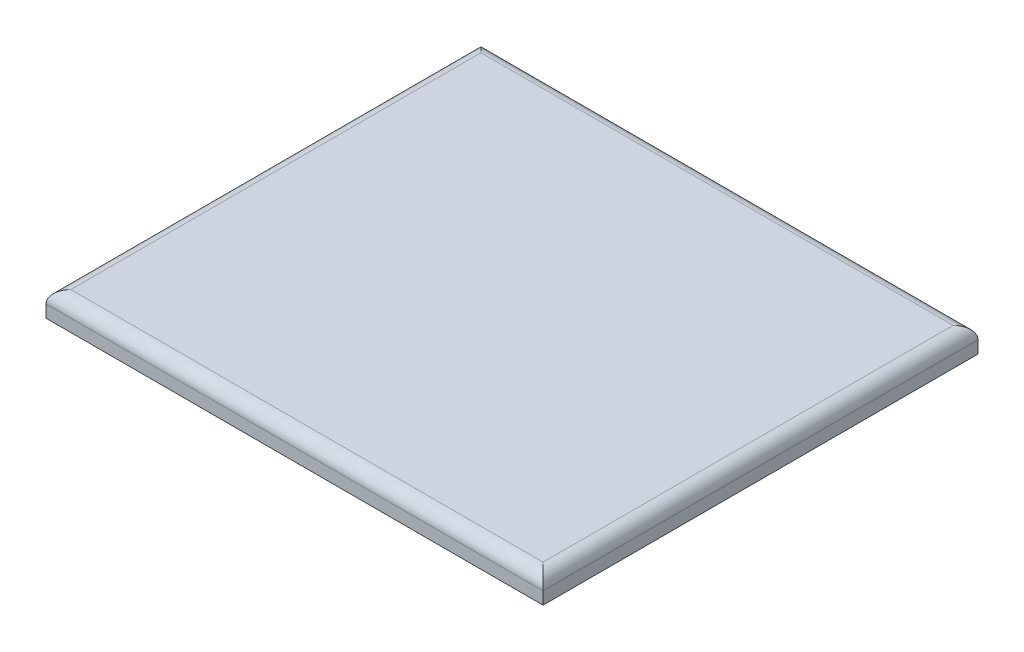
ISO-10303-21;
HEADER;
FILE_DESCRIPTION(('STEP AP214'),'2;1');
FILE_NAME('part.step','',(''),(''),'','','');
FILE_SCHEMA(('AUTOMOTIVE_DESIGN { 1 0 10303 214 1 1 1 1 }'));
ENDSEC;
DATA;
#1=APPLICATION_CONTEXT('core data for automotive mechanical design processes');
#2=APPLICATION_PROTOCOL_DEFINITION('international standard','automotive_design',2000,#1);
#3=PRODUCT_CONTEXT('',#1,'mechanical');
#4=PRODUCT('Part','Part','',(#3));
#5=PRODUCT_RELATED_PRODUCT_CATEGORY('part','',(#4));
#6=PRODUCT_DEFINITION_FORMATION('','',#4);
#7=PRODUCT_DEFINITION_CONTEXT('part definition',#1,'design');
#8=PRODUCT_DEFINITION('design','',#6,#7);
#9=PRODUCT_DEFINITION_SHAPE('','',#8);
#10=(LENGTH_UNIT() NAMED_UNIT(*) SI_UNIT(.MILLI.,.METRE.));
#11=(NAMED_UNIT(*) PLANE_ANGLE_UNIT() SI_UNIT($,.RADIAN.));
#12=(NAMED_UNIT(*) SI_UNIT($,.STERADIAN.) SOLID_ANGLE_UNIT());
#13=UNCERTAINTY_MEASURE_WITH_UNIT(LENGTH_MEASURE(1.E-05),#10,'distance_accuracy_value','');
#14=(GEOMETRIC_REPRESENTATION_CONTEXT(3) GLOBAL_UNCERTAINTY_ASSIGNED_CONTEXT((#13)) GLOBAL_UNIT_ASSIGNED_CONTEXT((#10,
#11,#12)) REPRESENTATION_CONTEXT('',''));
#15=CARTESIAN_POINT('',(0.,0.,0.));
#16=DIRECTION('',(0.,0.,1.));
#17=DIRECTION('',(1.,0.,0.));
#18=AXIS2_PLACEMENT_3D('',#15,#16,#17);
#19=CARTESIAN_POINT('',(200.,20.,175.));
#20=DIRECTION('',(-1.,0.,0.));
#21=DIRECTION('',(0.,0.,1.));
#22=AXIS2_PLACEMENT_3D('',#19,#20,#21);
#23=PLANE('',#22);
#24=DIRECTION('',(0.,-1.,0.));
#25=VECTOR('',#24,1.);
#26=CARTESIAN_POINT('',(200.,20.,-175.));
#27=LINE('',#26,#25);
#28=CARTESIAN_POINT('',(200.,10.,-175.));
#29=VERTEX_POINT('',#28);
#30=CARTESIAN_POINT('',(200.,0.,-175.));
#31=VERTEX_POINT('',#30);
#32=EDGE_CURVE('E86',#29,#31,#27,.T.);
#33=ORIENTED_EDGE('',*,*,#32,.F.);
#34=DIRECTION('',(0.,0.,-1.));
#35=VECTOR('',#34,1.);
#36=CARTESIAN_POINT('',(200.,10.,175.));
#37=LINE('',#36,#35);
#38=CARTESIAN_POINT('',(200.,10.,175.));
#39=VERTEX_POINT('',#38);
#40=EDGE_CURVE('E11',#29,#39,#37,.F.);
#41=ORIENTED_EDGE('',*,*,#40,.T.);
#42=DIRECTION('',(0.,-1.,0.));
#43=VECTOR('',#42,1.);
#44=CARTESIAN_POINT('',(200.,20.,175.));
#45=LINE('',#44,#43);
#46=CARTESIAN_POINT('',(200.,0.,175.));
#47=VERTEX_POINT('',#46);
#48=EDGE_CURVE('E106',#39,#47,#45,.T.);
#49=ORIENTED_EDGE('',*,*,#48,.T.);
#50=DIRECTION('',(0.,0.,-1.));
#51=VECTOR('',#50,1.);
#52=CARTESIAN_POINT('',(200.,0.,175.));
#53=LINE('',#52,#51);
#54=EDGE_CURVE('E101',#47,#31,#53,.T.);
#55=ORIENTED_EDGE('',*,*,#54,.T.);
#56=EDGE_LOOP('',(#33,#41,#49,#55));
#57=FACE_BOUND('',#56,.T.);
#58=ADVANCED_FACE('F34',(#57),#23,.F.);
#59=CARTESIAN_POINT('',(-200.,20.,-175.));
#60=DIRECTION('',(0.,0.,1.));
#61=DIRECTION('',(1.,0.,0.));
#62=AXIS2_PLACEMENT_3D('',#59,#60,#61);
#63=PLANE('',#62);
#64=DIRECTION('',(0.,-1.,0.));
#65=VECTOR('',#64,1.);
#66=CARTESIAN_POINT('',(-200.,20.,-175.));
#67=LINE('',#66,#65);
#68=CARTESIAN_POINT('',(-200.,10.,-175.));
#69=VERTEX_POINT('',#68);
#70=CARTESIAN_POINT('',(-200.,0.,-175.));
#71=VERTEX_POINT('',#70);
#72=EDGE_CURVE('E95',#69,#71,#67,.T.);
#73=ORIENTED_EDGE('',*,*,#72,.F.);
#74=DIRECTION('',(-1.,0.,0.));
#75=VECTOR('',#74,1.);
#76=CARTESIAN_POINT('',(-200.,10.,-175.));
#77=LINE('',#76,#75);
#78=EDGE_CURVE('E43',#69,#29,#77,.F.);
#79=ORIENTED_EDGE('',*,*,#78,.T.);
#80=ORIENTED_EDGE('',*,*,#32,.T.);
#81=DIRECTION('',(-1.,0.,0.));
#82=VECTOR('',#81,1.);
#83=CARTESIAN_POINT('',(-200.,0.,-175.));
#84=LINE('',#83,#82);
#85=EDGE_CURVE('E89',#31,#71,#84,.T.);
#86=ORIENTED_EDGE('',*,*,#85,.T.);
#87=EDGE_LOOP('',(#73,#79,#80,#86));
#88=FACE_BOUND('',#87,.T.);
#89=ADVANCED_FACE('F88',(#88),#63,.F.);
#90=CARTESIAN_POINT('',(-200.,20.,175.));
#91=DIRECTION('',(1.,0.,0.));
#92=DIRECTION('',(0.,0.,-1.));
#93=AXIS2_PLACEMENT_3D('',#90,#91,#92);
#94=PLANE('',#93);
#95=DIRECTION('',(0.,-1.,0.));
#96=VECTOR('',#95,1.);
#97=CARTESIAN_POINT('',(-200.,20.,175.));
#98=LINE('',#97,#96);
#99=CARTESIAN_POINT('',(-200.,10.,175.));
#100=VERTEX_POINT('',#99);
#101=CARTESIAN_POINT('',(-200.,0.,175.));
#102=VERTEX_POINT('',#101);
#103=EDGE_CURVE('E116',#100,#102,#98,.T.);
#104=ORIENTED_EDGE('',*,*,#103,.F.);
#105=DIRECTION('',(0.,0.,1.));
#106=VECTOR('',#105,1.);
#107=CARTESIAN_POINT('',(-200.,10.,175.));
#108=LINE('',#107,#106);
#109=EDGE_CURVE('E58',#100,#69,#108,.F.);
#110=ORIENTED_EDGE('',*,*,#109,.T.);
#111=ORIENTED_EDGE('',*,*,#72,.T.);
#112=DIRECTION('',(0.,0.,1.));
#113=VECTOR('',#112,1.);
#114=CARTESIAN_POINT('',(-200.,0.,175.));
#115=LINE('',#114,#113);
#116=EDGE_CURVE('E103',#71,#102,#115,.T.);
#117=ORIENTED_EDGE('',*,*,#116,.T.);
#118=EDGE_LOOP('',(#104,#110,#111,#117));
#119=FACE_BOUND('',#118,.T.);
#120=ADVANCED_FACE('F154',(#119),#94,.F.);
#121=CARTESIAN_POINT('',(-200.,20.,175.));
#122=DIRECTION('',(0.,0.,-1.));
#123=DIRECTION('',(-1.,0.,0.));
#124=AXIS2_PLACEMENT_3D('',#121,#122,#123);
#125=PLANE('',#124);
#126=ORIENTED_EDGE('',*,*,#48,.F.);
#127=DIRECTION('',(1.,0.,0.));
#128=VECTOR('',#127,1.);
#129=CARTESIAN_POINT('',(-200.,10.,175.));
#130=LINE('',#129,#128);
#131=EDGE_CURVE('E127',#39,#100,#130,.F.);
#132=ORIENTED_EDGE('',*,*,#131,.T.);
#133=ORIENTED_EDGE('',*,*,#103,.T.);
#134=DIRECTION('',(1.,0.,0.));
#135=VECTOR('',#134,1.);
#136=CARTESIAN_POINT('',(-200.,0.,175.));
#137=LINE('',#136,#135);
#138=EDGE_CURVE('E113',#102,#47,#137,.T.);
#139=ORIENTED_EDGE('',*,*,#138,.T.);
#140=EDGE_LOOP('',(#126,#132,#133,#139));
#141=FACE_BOUND('',#140,.T.);
#142=ADVANCED_FACE('F153',(#141),#125,.F.);
#143=CARTESIAN_POINT('',(0.,20.,0.));
#144=DIRECTION('',(0.,-1.,0.));
#145=DIRECTION('',(0.,0.,-1.));
#146=AXIS2_PLACEMENT_3D('',#143,#144,#145);
#147=PLANE('',#146);
#148=DIRECTION('',(0.,0.,1.));
#149=VECTOR('',#148,1.);
#150=CARTESIAN_POINT('',(-190.,20.,0.));
#151=LINE('',#150,#149);
#152=CARTESIAN_POINT('',(-190.,20.,-165.));
#153=VERTEX_POINT('',#152);
#154=CARTESIAN_POINT('',(-190.,20.,165.));
#155=VERTEX_POINT('',#154);
#156=EDGE_CURVE('E122',#153,#155,#151,.T.);
#157=ORIENTED_EDGE('',*,*,#156,.T.);
#158=DIRECTION('',(1.,0.,0.));
#159=VECTOR('',#158,1.);
#160=CARTESIAN_POINT('',(0.,20.,165.));
#161=LINE('',#160,#159);
#162=CARTESIAN_POINT('',(190.,20.,165.));
#163=VERTEX_POINT('',#162);
#164=EDGE_CURVE('E124',#155,#163,#161,.T.);
#165=ORIENTED_EDGE('',*,*,#164,.T.);
#166=DIRECTION('',(0.,0.,-1.));
#167=VECTOR('',#166,1.);
#168=CARTESIAN_POINT('',(190.,20.,0.));
#169=LINE('',#168,#167);
#170=CARTESIAN_POINT('',(190.,20.,-165.));
#171=VERTEX_POINT('',#170);
#172=EDGE_CURVE('E94',#163,#171,#169,.T.);
#173=ORIENTED_EDGE('',*,*,#172,.T.);
#174=DIRECTION('',(-1.,0.,0.));
#175=VECTOR('',#174,1.);
#176=CARTESIAN_POINT('',(0.,20.,-165.));
#177=LINE('',#176,#175);
#178=EDGE_CURVE('E120',#171,#153,#177,.T.);
#179=ORIENTED_EDGE('',*,*,#178,.T.);
#180=EDGE_LOOP('',(#157,#165,#173,#179));
#181=FACE_BOUND('',#180,.T.);
#182=ADVANCED_FACE('F146',(#181),#147,.F.);
#183=CARTESIAN_POINT('',(0.,0.,0.));
#184=DIRECTION('',(0.,-1.,0.));
#185=DIRECTION('',(0.,0.,-1.));
#186=AXIS2_PLACEMENT_3D('',#183,#184,#185);
#187=PLANE('',#186);
#188=ORIENTED_EDGE('',*,*,#54,.F.);
#189=ORIENTED_EDGE('',*,*,#138,.F.);
#190=ORIENTED_EDGE('',*,*,#116,.F.);
#191=ORIENTED_EDGE('',*,*,#85,.F.);
#192=EDGE_LOOP('',(#188,#189,#190,#191));
#193=FACE_BOUND('',#192,.T.);
#194=ADVANCED_FACE('F99',(#193),#187,.T.);
#195=CARTESIAN_POINT('',(0.,10.,-165.));
#196=DIRECTION('',(-1.,0.,0.));
#197=DIRECTION('',(0.,0.,1.));
#198=AXIS2_PLACEMENT_3D('',#195,#196,#197);
#199=CYLINDRICAL_SURFACE('',#198,10.);
#200=CARTESIAN_POINT('',(190.,10.,-165.));
#201=DIRECTION('',(-0.707106781186547,0.,-0.707106781186547));
#202=DIRECTION('',(0.707106781186547,0.,-0.707106781186547));
#203=AXIS2_PLACEMENT_3D('',#200,#201,#202);
#204=ELLIPSE('',#203,14.1421356237309,10.);
#205=EDGE_CURVE('E110',#29,#171,#204,.F.);
#206=ORIENTED_EDGE('',*,*,#205,.F.);
#207=ORIENTED_EDGE('',*,*,#78,.F.);
#208=CARTESIAN_POINT('',(-190.,10.,-165.));
#209=DIRECTION('',(-0.707106781186547,0.,0.707106781186547));
#210=DIRECTION('',(-0.707106781186547,0.,-0.707106781186547));
#211=AXIS2_PLACEMENT_3D('',#208,#209,#210);
#212=ELLIPSE('',#211,14.1421356237309,10.);
#213=EDGE_CURVE('E38',#153,#69,#212,.T.);
#214=ORIENTED_EDGE('',*,*,#213,.F.);
#215=ORIENTED_EDGE('',*,*,#178,.F.);
#216=EDGE_LOOP('',(#206,#207,#214,#215));
#217=FACE_BOUND('',#216,.T.);
#218=ADVANCED_FACE('F36',(#217),#199,.T.);
#219=CARTESIAN_POINT('',(-190.,10.,0.));
#220=DIRECTION('',(0.,0.,1.));
#221=DIRECTION('',(1.,0.,0.));
#222=AXIS2_PLACEMENT_3D('',#219,#220,#221);
#223=CYLINDRICAL_SURFACE('',#222,10.);
#224=ORIENTED_EDGE('',*,*,#213,.T.);
#225=ORIENTED_EDGE('',*,*,#109,.F.);
#226=CARTESIAN_POINT('',(-190.,10.,165.));
#227=DIRECTION('',(0.707106781186547,0.,0.707106781186547));
#228=DIRECTION('',(-0.707106781186547,0.,0.707106781186547));
#229=AXIS2_PLACEMENT_3D('',#226,#227,#228);
#230=ELLIPSE('',#229,14.1421356237309,10.);
#231=EDGE_CURVE('E134',#155,#100,#230,.T.);
#232=ORIENTED_EDGE('',*,*,#231,.F.);
#233=ORIENTED_EDGE('',*,*,#156,.F.);
#234=EDGE_LOOP('',(#224,#225,#232,#233));
#235=FACE_BOUND('',#234,.T.);
#236=ADVANCED_FACE('F171',(#235),#223,.T.);
#237=CARTESIAN_POINT('',(190.,10.,0.));
#238=DIRECTION('',(0.,0.,-1.));
#239=DIRECTION('',(-1.,0.,0.));
#240=AXIS2_PLACEMENT_3D('',#237,#238,#239);
#241=CYLINDRICAL_SURFACE('',#240,10.);
#242=ORIENTED_EDGE('',*,*,#205,.T.);
#243=ORIENTED_EDGE('',*,*,#172,.F.);
#244=CARTESIAN_POINT('',(190.,10.,165.));
#245=DIRECTION('',(0.707106781186547,0.,-0.707106781186547));
#246=DIRECTION('',(-0.707106781186547,0.,-0.707106781186547));
#247=AXIS2_PLACEMENT_3D('',#244,#245,#246);
#248=ELLIPSE('',#247,14.1421356237309,10.);
#249=EDGE_CURVE('E132',#39,#163,#248,.F.);
#250=ORIENTED_EDGE('',*,*,#249,.F.);
#251=ORIENTED_EDGE('',*,*,#40,.F.);
#252=EDGE_LOOP('',(#242,#243,#250,#251));
#253=FACE_BOUND('',#252,.T.);
#254=ADVANCED_FACE('F139',(#253),#241,.T.);
#255=CARTESIAN_POINT('',(0.,10.,165.));
#256=DIRECTION('',(1.,0.,0.));
#257=DIRECTION('',(0.,0.,-1.));
#258=AXIS2_PLACEMENT_3D('',#255,#256,#257);
#259=CYLINDRICAL_SURFACE('',#258,10.);
#260=ORIENTED_EDGE('',*,*,#231,.T.);
#261=ORIENTED_EDGE('',*,*,#131,.F.);
#262=ORIENTED_EDGE('',*,*,#249,.T.);
#263=ORIENTED_EDGE('',*,*,#164,.F.);
#264=EDGE_LOOP('',(#260,#261,#262,#263));
#265=FACE_BOUND('',#264,.T.);
#266=ADVANCED_FACE('F150',(#265),#259,.T.);
#267=CLOSED_SHELL('',(#58,#89,#120,#142,#182,#194,#218,#236,#254,#266));
#268=MANIFOLD_SOLID_BREP('B2',#267);
#269=ADVANCED_BREP_SHAPE_REPRESENTATION('',(#18,#268),#14);
#270=SHAPE_DEFINITION_REPRESENTATION(#9,#269);
ENDSEC;
END-ISO-10303-21;
